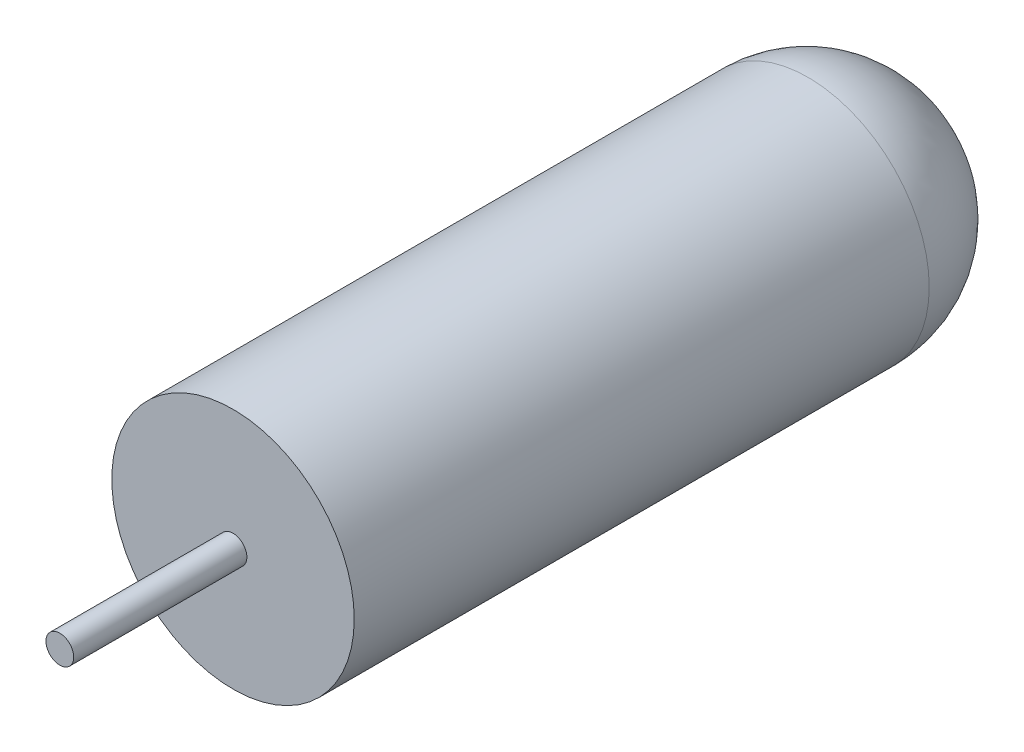
ISO-10303-21;
HEADER;
FILE_DESCRIPTION(('STEP AP214'),'2;1');
FILE_NAME('part.step','',(''),(''),'','','');
FILE_SCHEMA(('AUTOMOTIVE_DESIGN { 1 0 10303 214 1 1 1 1 }'));
ENDSEC;
DATA;
#1=APPLICATION_CONTEXT('core data for automotive mechanical design processes');
#2=APPLICATION_PROTOCOL_DEFINITION('international standard','automotive_design',2000,#1);
#3=PRODUCT_CONTEXT('',#1,'mechanical');
#4=PRODUCT('Part','Part','',(#3));
#5=PRODUCT_RELATED_PRODUCT_CATEGORY('part','',(#4));
#6=PRODUCT_DEFINITION_FORMATION('','',#4);
#7=PRODUCT_DEFINITION_CONTEXT('part definition',#1,'design');
#8=PRODUCT_DEFINITION('design','',#6,#7);
#9=PRODUCT_DEFINITION_SHAPE('','',#8);
#10=(LENGTH_UNIT() NAMED_UNIT(*) SI_UNIT(.MILLI.,.METRE.));
#11=(NAMED_UNIT(*) PLANE_ANGLE_UNIT() SI_UNIT($,.RADIAN.));
#12=(NAMED_UNIT(*) SI_UNIT($,.STERADIAN.) SOLID_ANGLE_UNIT());
#13=UNCERTAINTY_MEASURE_WITH_UNIT(LENGTH_MEASURE(1.E-05),#10,'distance_accuracy_value','');
#14=(GEOMETRIC_REPRESENTATION_CONTEXT(3) GLOBAL_UNCERTAINTY_ASSIGNED_CONTEXT((#13)) GLOBAL_UNIT_ASSIGNED_CONTEXT((#10,
#11,#12)) REPRESENTATION_CONTEXT('',''));
#15=CARTESIAN_POINT('',(0.,0.,0.));
#16=DIRECTION('',(0.,0.,1.));
#17=DIRECTION('',(1.,0.,0.));
#18=AXIS2_PLACEMENT_3D('',#15,#16,#17);
#19=CARTESIAN_POINT('',(0.,0.,100.));
#20=DIRECTION('',(0.,0.,-1.));
#21=DIRECTION('',(-1.,0.,0.));
#22=AXIS2_PLACEMENT_3D('',#19,#20,#21);
#23=CYLINDRICAL_SURFACE('',#22,17.5);
#24=CARTESIAN_POINT('',(0.,0.,17.));
#25=DIRECTION('',(0.,0.,1.));
#26=DIRECTION('',(1.,0.,0.));
#27=AXIS2_PLACEMENT_3D('',#24,#25,#26);
#28=CIRCLE('',#27,17.5);
#29=CARTESIAN_POINT('',(17.5,0.,17.));
#30=VERTEX_POINT('',#29);
#31=EDGE_CURVE('E47',#30,#30,#28,.T.);
#32=ORIENTED_EDGE('',*,*,#31,.T.);
#33=EDGE_LOOP('',(#32));
#34=FACE_BOUND('',#33,.T.);
#35=CARTESIAN_POINT('',(0.,0.,100.));
#36=DIRECTION('',(0.,0.,1.));
#37=DIRECTION('',(1.,0.,0.));
#38=AXIS2_PLACEMENT_3D('',#35,#36,#37);
#39=CIRCLE('',#38,17.5);
#40=CARTESIAN_POINT('',(17.5,0.,100.));
#41=VERTEX_POINT('',#40);
#42=EDGE_CURVE('E52',#41,#41,#39,.T.);
#43=ORIENTED_EDGE('',*,*,#42,.F.);
#44=EDGE_LOOP('',(#43));
#45=FACE_BOUND('',#44,.T.);
#46=ADVANCED_FACE('F39',(#34,#45),#23,.T.);
#47=CARTESIAN_POINT('',(0.,0.,100.));
#48=DIRECTION('',(0.,0.,1.));
#49=DIRECTION('',(1.,0.,0.));
#50=AXIS2_PLACEMENT_3D('',#47,#48,#49);
#51=PLANE('',#50);
#52=CARTESIAN_POINT('',(0.,0.,100.));
#53=DIRECTION('',(0.,0.,1.));
#54=DIRECTION('',(1.,0.,0.));
#55=AXIS2_PLACEMENT_3D('',#52,#53,#54);
#56=CIRCLE('',#55,2.);
#57=CARTESIAN_POINT('',(2.,0.,100.));
#58=VERTEX_POINT('',#57);
#59=EDGE_CURVE('E60',#58,#58,#56,.T.);
#60=ORIENTED_EDGE('',*,*,#59,.F.);
#61=EDGE_LOOP('',(#60));
#62=FACE_BOUND('',#61,.T.);
#63=ORIENTED_EDGE('',*,*,#42,.T.);
#64=EDGE_LOOP('',(#63));
#65=FACE_BOUND('',#64,.T.);
#66=ADVANCED_FACE('F76',(#62,#65),#51,.T.);
#67=CARTESIAN_POINT('',(0.,0.,0.));
#68=DIRECTION('',(0.,0.,1.));
#69=DIRECTION('',(1.,0.,0.));
#70=AXIS2_PLACEMENT_3D('',#67,#68,#69);
#71=PLANE('',#70);
#72=CARTESIAN_POINT('',(0.,0.,0.));
#73=DIRECTION('',(0.,0.,1.));
#74=DIRECTION('',(1.,0.,0.));
#75=AXIS2_PLACEMENT_3D('',#72,#73,#74);
#76=CIRCLE('',#75,0.500000000000004);
#77=CARTESIAN_POINT('',(0.500000000000004,0.,0.));
#78=VERTEX_POINT('',#77);
#79=EDGE_CURVE('E10',#78,#78,#76,.F.);
#80=ORIENTED_EDGE('',*,*,#79,.T.);
#81=EDGE_LOOP('',(#80));
#82=FACE_BOUND('',#81,.T.);
#83=ADVANCED_FACE('F79',(#82),#71,.F.);
#84=CARTESIAN_POINT('',(0.,0.,17.));
#85=DIRECTION('',(0.,0.,1.));
#86=DIRECTION('',(1.,0.,0.));
#87=AXIS2_PLACEMENT_3D('',#84,#85,#86);
#88=DEGENERATE_TOROIDAL_SURFACE('',#87,0.500000000000004,17.,.T.);
#89=ORIENTED_EDGE('',*,*,#79,.F.);
#90=EDGE_LOOP('',(#89));
#91=FACE_BOUND('',#90,.T.);
#92=ORIENTED_EDGE('',*,*,#31,.F.);
#93=EDGE_LOOP('',(#92));
#94=FACE_BOUND('',#93,.T.);
#95=ADVANCED_FACE('F41',(#91,#94),#88,.T.);
#96=CARTESIAN_POINT('',(0.,0.,125.));
#97=DIRECTION('',(0.,0.,-1.));
#98=DIRECTION('',(-1.,0.,0.));
#99=AXIS2_PLACEMENT_3D('',#96,#97,#98);
#100=CYLINDRICAL_SURFACE('',#99,2.);
#101=CARTESIAN_POINT('',(0.,0.,125.));
#102=DIRECTION('',(0.,0.,1.));
#103=DIRECTION('',(1.,0.,0.));
#104=AXIS2_PLACEMENT_3D('',#101,#102,#103);
#105=CIRCLE('',#104,2.);
#106=CARTESIAN_POINT('',(2.,0.,125.));
#107=VERTEX_POINT('',#106);
#108=EDGE_CURVE('E57',#107,#107,#105,.T.);
#109=ORIENTED_EDGE('',*,*,#108,.F.);
#110=EDGE_LOOP('',(#109));
#111=FACE_BOUND('',#110,.T.);
#112=ORIENTED_EDGE('',*,*,#59,.T.);
#113=EDGE_LOOP('',(#112));
#114=FACE_BOUND('',#113,.T.);
#115=ADVANCED_FACE('F70',(#111,#114),#100,.T.);
#116=CARTESIAN_POINT('',(0.,0.,125.));
#117=DIRECTION('',(0.,0.,1.));
#118=DIRECTION('',(1.,0.,0.));
#119=AXIS2_PLACEMENT_3D('',#116,#117,#118);
#120=PLANE('',#119);
#121=ORIENTED_EDGE('',*,*,#108,.T.);
#122=EDGE_LOOP('',(#121));
#123=FACE_BOUND('',#122,.T.);
#124=ADVANCED_FACE('F68',(#123),#120,.T.);
#125=CLOSED_SHELL('',(#46,#66,#83,#95,#115,#124));
#126=MANIFOLD_SOLID_BREP('B2',#125);
#127=ADVANCED_BREP_SHAPE_REPRESENTATION('',(#18,#126),#14);
#128=SHAPE_DEFINITION_REPRESENTATION(#9,#127);
ENDSEC;
END-ISO-10303-21;
